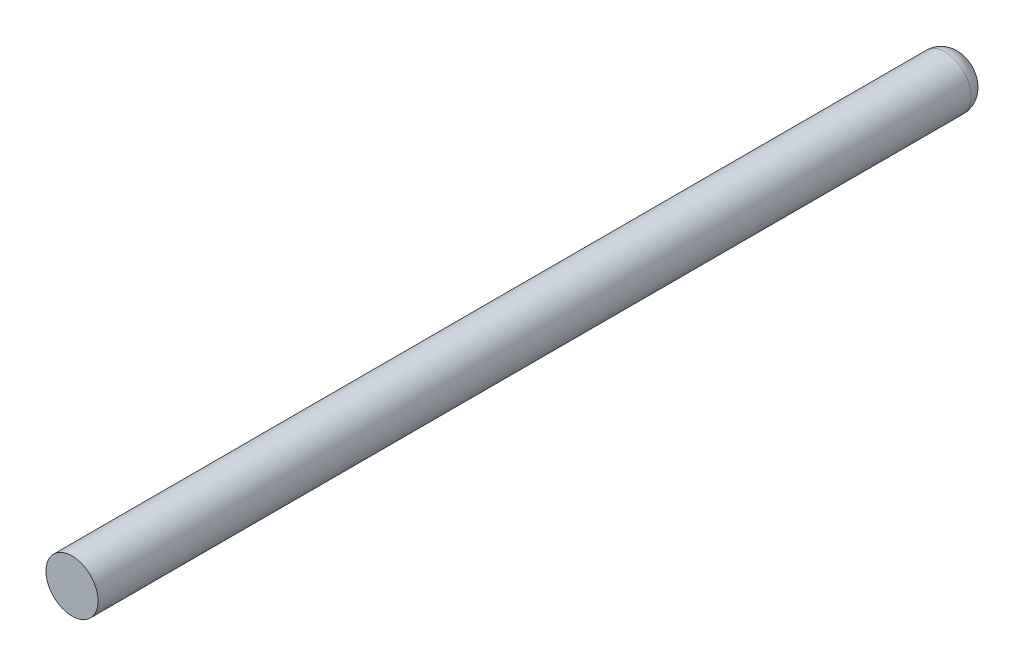
ISO-10303-21;
HEADER;
FILE_DESCRIPTION(('STEP AP214'),'2;1');
FILE_NAME('part.step','',(''),(''),'','','');
FILE_SCHEMA(('AUTOMOTIVE_DESIGN { 1 0 10303 214 1 1 1 1 }'));
ENDSEC;
DATA;
#1=APPLICATION_CONTEXT('core data for automotive mechanical design processes');
#2=APPLICATION_PROTOCOL_DEFINITION('international standard','automotive_design',2000,#1);
#3=PRODUCT_CONTEXT('',#1,'mechanical');
#4=PRODUCT('Part','Part','',(#3));
#5=PRODUCT_RELATED_PRODUCT_CATEGORY('part','',(#4));
#6=PRODUCT_DEFINITION_FORMATION('','',#4);
#7=PRODUCT_DEFINITION_CONTEXT('part definition',#1,'design');
#8=PRODUCT_DEFINITION('design','',#6,#7);
#9=PRODUCT_DEFINITION_SHAPE('','',#8);
#10=(LENGTH_UNIT() NAMED_UNIT(*) SI_UNIT(.MILLI.,.METRE.));
#11=(NAMED_UNIT(*) PLANE_ANGLE_UNIT() SI_UNIT($,.RADIAN.));
#12=(NAMED_UNIT(*) SI_UNIT($,.STERADIAN.) SOLID_ANGLE_UNIT());
#13=UNCERTAINTY_MEASURE_WITH_UNIT(LENGTH_MEASURE(1.E-05),#10,'distance_accuracy_value','');
#14=(GEOMETRIC_REPRESENTATION_CONTEXT(3) GLOBAL_UNCERTAINTY_ASSIGNED_CONTEXT((#13)) GLOBAL_UNIT_ASSIGNED_CONTEXT((#10,
#11,#12)) REPRESENTATION_CONTEXT('',''));
#15=CARTESIAN_POINT('',(0.,0.,0.));
#16=DIRECTION('',(0.,0.,1.));
#17=DIRECTION('',(1.,0.,0.));
#18=AXIS2_PLACEMENT_3D('',#15,#16,#17);
#19=CARTESIAN_POINT('',(0.,0.,135.636));
#20=DIRECTION('',(0.,0.,-1.));
#21=DIRECTION('',(-1.,0.,0.));
#22=AXIS2_PLACEMENT_3D('',#19,#20,#21);
#23=CYLINDRICAL_SURFACE('',#22,3.9751);
#24=CARTESIAN_POINT('',(0.,0.,2.53999999999999));
#25=DIRECTION('',(0.,0.,1.));
#26=DIRECTION('',(1.,0.,0.));
#27=AXIS2_PLACEMENT_3D('',#24,#25,#26);
#28=CIRCLE('',#27,3.9751);
#29=CARTESIAN_POINT('',(3.9751,0.,2.53999999999999));
#30=VERTEX_POINT('',#29);
#31=EDGE_CURVE('E41',#30,#30,#28,.T.);
#32=ORIENTED_EDGE('',*,*,#31,.T.);
#33=EDGE_LOOP('',(#32));
#34=FACE_BOUND('',#33,.T.);
#35=CARTESIAN_POINT('',(0.,0.,135.636));
#36=DIRECTION('',(0.,0.,1.));
#37=DIRECTION('',(1.,0.,0.));
#38=AXIS2_PLACEMENT_3D('',#35,#36,#37);
#39=CIRCLE('',#38,3.9751);
#40=CARTESIAN_POINT('',(3.9751,0.,135.636));
#41=VERTEX_POINT('',#40);
#42=EDGE_CURVE('E45',#41,#41,#39,.T.);
#43=ORIENTED_EDGE('',*,*,#42,.F.);
#44=EDGE_LOOP('',(#43));
#45=FACE_BOUND('',#44,.T.);
#46=ADVANCED_FACE('F34',(#34,#45),#23,.T.);
#47=CARTESIAN_POINT('',(0.,0.,135.636));
#48=DIRECTION('',(0.,0.,1.));
#49=DIRECTION('',(1.,0.,0.));
#50=AXIS2_PLACEMENT_3D('',#47,#48,#49);
#51=PLANE('',#50);
#52=ORIENTED_EDGE('',*,*,#42,.T.);
#53=EDGE_LOOP('',(#52));
#54=FACE_BOUND('',#53,.T.);
#55=ADVANCED_FACE('F52',(#54),#51,.T.);
#56=CARTESIAN_POINT('',(0.,0.,0.));
#57=DIRECTION('',(0.,0.,1.));
#58=DIRECTION('',(1.,0.,0.));
#59=AXIS2_PLACEMENT_3D('',#56,#57,#58);
#60=PLANE('',#59);
#61=CARTESIAN_POINT('',(0.,0.,0.));
#62=DIRECTION('',(0.,0.,1.));
#63=DIRECTION('',(1.,0.,0.));
#64=AXIS2_PLACEMENT_3D('',#61,#62,#63);
#65=CIRCLE('',#64,1.4351);
#66=CARTESIAN_POINT('',(1.4351,0.,0.));
#67=VERTEX_POINT('',#66);
#68=EDGE_CURVE('E10',#67,#67,#65,.F.);
#69=ORIENTED_EDGE('',*,*,#68,.T.);
#70=EDGE_LOOP('',(#69));
#71=FACE_BOUND('',#70,.T.);
#72=ADVANCED_FACE('F58',(#71),#60,.F.);
#73=CARTESIAN_POINT('',(0.,0.,2.53999999999999));
#74=DIRECTION('',(0.,0.,1.));
#75=DIRECTION('',(1.,0.,0.));
#76=AXIS2_PLACEMENT_3D('',#73,#74,#75);
#77=DEGENERATE_TOROIDAL_SURFACE('',#76,1.4351,2.54,.T.);
#78=ORIENTED_EDGE('',*,*,#68,.F.);
#79=EDGE_LOOP('',(#78));
#80=FACE_BOUND('',#79,.T.);
#81=ORIENTED_EDGE('',*,*,#31,.F.);
#82=EDGE_LOOP('',(#81));
#83=FACE_BOUND('',#82,.T.);
#84=ADVANCED_FACE('F36',(#80,#83),#77,.T.);
#85=CLOSED_SHELL('',(#46,#55,#72,#84));
#86=MANIFOLD_SOLID_BREP('B2',#85);
#87=ADVANCED_BREP_SHAPE_REPRESENTATION('',(#18,#86),#14);
#88=SHAPE_DEFINITION_REPRESENTATION(#9,#87);
ENDSEC;
END-ISO-10303-21;
